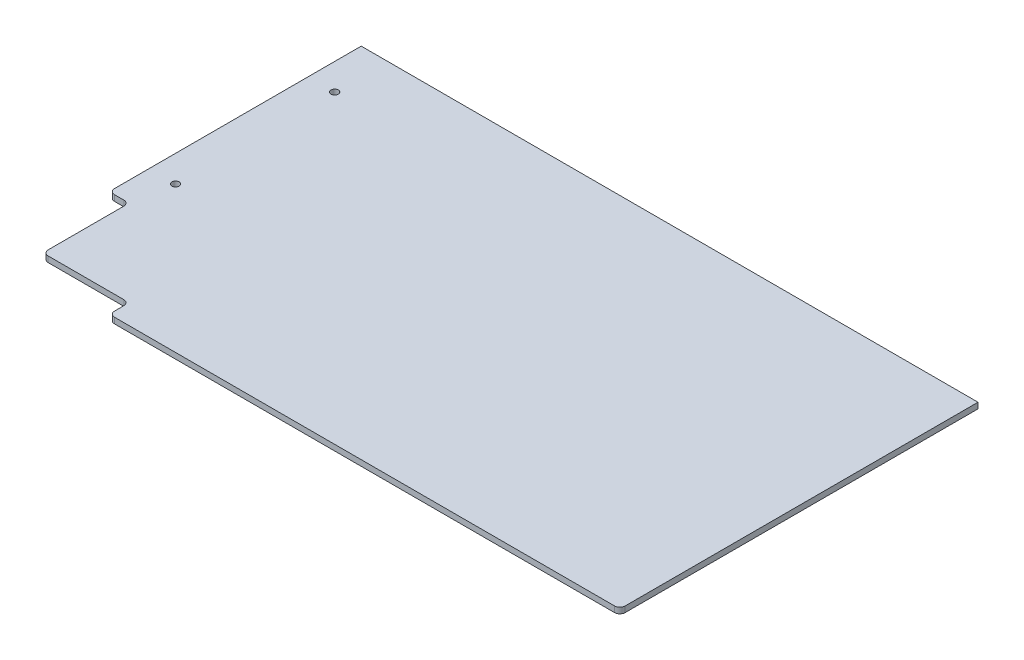
ISO-10303-21;
HEADER;
FILE_DESCRIPTION(('STEP AP214'),'2;1');
FILE_NAME('part.step','',(''),(''),'','','');
FILE_SCHEMA(('AUTOMOTIVE_DESIGN { 1 0 10303 214 1 1 1 1 }'));
ENDSEC;
DATA;
#1=APPLICATION_CONTEXT('core data for automotive mechanical design processes');
#2=APPLICATION_PROTOCOL_DEFINITION('international standard','automotive_design',2000,#1);
#3=PRODUCT_CONTEXT('',#1,'mechanical');
#4=PRODUCT('Part','Part','',(#3));
#5=PRODUCT_RELATED_PRODUCT_CATEGORY('part','',(#4));
#6=PRODUCT_DEFINITION_FORMATION('','',#4);
#7=PRODUCT_DEFINITION_CONTEXT('part definition',#1,'design');
#8=PRODUCT_DEFINITION('design','',#6,#7);
#9=PRODUCT_DEFINITION_SHAPE('','',#8);
#10=(LENGTH_UNIT() NAMED_UNIT(*) SI_UNIT(.MILLI.,.METRE.));
#11=(NAMED_UNIT(*) PLANE_ANGLE_UNIT() SI_UNIT($,.RADIAN.));
#12=(NAMED_UNIT(*) SI_UNIT($,.STERADIAN.) SOLID_ANGLE_UNIT());
#13=UNCERTAINTY_MEASURE_WITH_UNIT(LENGTH_MEASURE(1.E-05),#10,'distance_accuracy_value','');
#14=(GEOMETRIC_REPRESENTATION_CONTEXT(3) GLOBAL_UNCERTAINTY_ASSIGNED_CONTEXT((#13)) GLOBAL_UNIT_ASSIGNED_CONTEXT((#10,
#11,#12)) REPRESENTATION_CONTEXT('',''));
#15=CARTESIAN_POINT('',(0.,0.,0.));
#16=DIRECTION('',(0.,0.,1.));
#17=DIRECTION('',(1.,0.,0.));
#18=AXIS2_PLACEMENT_3D('',#15,#16,#17);
#19=CARTESIAN_POINT('',(0.,2.778125,0.));
#20=DIRECTION('',(1.,0.,0.));
#21=DIRECTION('',(0.,0.,-1.));
#22=AXIS2_PLACEMENT_3D('',#19,#20,#21);
#23=PLANE('',#22);
#24=DIRECTION('',(0.,0.,1.));
#25=VECTOR('',#24,1.);
#26=CARTESIAN_POINT('',(0.,0.,0.));
#27=LINE('',#26,#25);
#28=CARTESIAN_POINT('',(0.,0.,-190.5));
#29=VERTEX_POINT('',#28);
#30=CARTESIAN_POINT('',(0.,0.,-72.39));
#31=VERTEX_POINT('',#30);
#32=EDGE_CURVE('E170',#29,#31,#27,.T.);
#33=ORIENTED_EDGE('',*,*,#32,.T.);
#34=DIRECTION('',(0.,1.,0.));
#35=VECTOR('',#34,1.);
#36=CARTESIAN_POINT('',(0.,2.778125,-72.39));
#37=LINE('',#36,#35);
#38=CARTESIAN_POINT('',(0.,2.778125,-72.39));
#39=VERTEX_POINT('',#38);
#40=EDGE_CURVE('E226',#31,#39,#37,.T.);
#41=ORIENTED_EDGE('',*,*,#40,.T.);
#42=DIRECTION('',(0.,0.,1.));
#43=VECTOR('',#42,1.);
#44=CARTESIAN_POINT('',(0.,2.778125,0.));
#45=LINE('',#44,#43);
#46=CARTESIAN_POINT('',(0.,2.778125,-190.5));
#47=VERTEX_POINT('',#46);
#48=EDGE_CURVE('E171',#47,#39,#45,.T.);
#49=ORIENTED_EDGE('',*,*,#48,.F.);
#50=DIRECTION('',(0.,-1.,0.));
#51=VECTOR('',#50,1.);
#52=CARTESIAN_POINT('',(0.,2.778125,-190.5));
#53=LINE('',#52,#51);
#54=EDGE_CURVE('E179',#47,#29,#53,.T.);
#55=ORIENTED_EDGE('',*,*,#54,.T.);
#56=EDGE_LOOP('',(#33,#41,#49,#55));
#57=FACE_BOUND('',#56,.T.);
#58=ADVANCED_FACE('F39',(#57),#23,.F.);
#59=CARTESIAN_POINT('',(0.,2.778125,-190.5));
#60=DIRECTION('',(0.,0.,1.));
#61=DIRECTION('',(1.,0.,0.));
#62=AXIS2_PLACEMENT_3D('',#59,#60,#61);
#63=PLANE('',#62);
#64=DIRECTION('',(-1.,0.,0.));
#65=VECTOR('',#64,1.);
#66=CARTESIAN_POINT('',(0.,2.778125,-190.5));
#67=LINE('',#66,#65);
#68=CARTESIAN_POINT('',(295.275,2.778125,-190.5));
#69=VERTEX_POINT('',#68);
#70=EDGE_CURVE('E165',#69,#47,#67,.T.);
#71=ORIENTED_EDGE('',*,*,#70,.F.);
#72=DIRECTION('',(0.,1.,0.));
#73=VECTOR('',#72,1.);
#74=CARTESIAN_POINT('',(295.275,0.,-190.5));
#75=LINE('',#74,#73);
#76=CARTESIAN_POINT('',(295.275,0.,-190.5));
#77=VERTEX_POINT('',#76);
#78=EDGE_CURVE('E151',#77,#69,#75,.T.);
#79=ORIENTED_EDGE('',*,*,#78,.F.);
#80=DIRECTION('',(-1.,0.,0.));
#81=VECTOR('',#80,1.);
#82=CARTESIAN_POINT('',(0.,0.,-190.5));
#83=LINE('',#82,#81);
#84=EDGE_CURVE('E163',#77,#29,#83,.T.);
#85=ORIENTED_EDGE('',*,*,#84,.T.);
#86=ORIENTED_EDGE('',*,*,#54,.F.);
#87=EDGE_LOOP('',(#71,#79,#85,#86));
#88=FACE_BOUND('',#87,.T.);
#89=ADVANCED_FACE('F161',(#88),#63,.F.);
#90=CARTESIAN_POINT('',(0.,2.778125,0.));
#91=DIRECTION('',(0.,-1.,0.));
#92=DIRECTION('',(0.,0.,-1.));
#93=AXIS2_PLACEMENT_3D('',#90,#91,#92);
#94=PLANE('',#93);
#95=CARTESIAN_POINT('',(12.7,2.778125,-165.1));
#96=DIRECTION('',(0.,1.,0.));
#97=DIRECTION('',(0.,0.,1.));
#98=AXIS2_PLACEMENT_3D('',#95,#96,#97);
#99=CIRCLE('',#98,1.7526);
#100=CARTESIAN_POINT('',(12.7,2.778125,-163.3474));
#101=VERTEX_POINT('',#100);
#102=EDGE_CURVE('E446',#101,#101,#99,.T.);
#103=ORIENTED_EDGE('',*,*,#102,.F.);
#104=EDGE_LOOP('',(#103));
#105=FACE_BOUND('',#104,.T.);
#106=CARTESIAN_POINT('',(12.7,2.778125,-88.9));
#107=DIRECTION('',(0.,1.,0.));
#108=DIRECTION('',(0.,0.,1.));
#109=AXIS2_PLACEMENT_3D('',#106,#107,#108);
#110=CIRCLE('',#109,1.7526);
#111=CARTESIAN_POINT('',(12.7,2.778125,-87.1474));
#112=VERTEX_POINT('',#111);
#113=EDGE_CURVE('E166',#112,#112,#110,.T.);
#114=ORIENTED_EDGE('',*,*,#113,.F.);
#115=EDGE_LOOP('',(#114));
#116=FACE_BOUND('',#115,.T.);
#117=DIRECTION('',(-1.,0.,0.));
#118=VECTOR('',#117,1.);
#119=CARTESIAN_POINT('',(0.,2.778125,-19.05));
#120=LINE('',#119,#118);
#121=CARTESIAN_POINT('',(292.735,2.778125,-19.05));
#122=VERTEX_POINT('',#121);
#123=CARTESIAN_POINT('',(53.34,2.778125,-19.05));
#124=VERTEX_POINT('',#123);
#125=EDGE_CURVE('E257',#122,#124,#120,.T.);
#126=ORIENTED_EDGE('',*,*,#125,.F.);
#127=CARTESIAN_POINT('',(292.735,2.778125,-21.59));
#128=DIRECTION('',(0.,-1.,0.));
#129=DIRECTION('',(0.,0.,-1.));
#130=AXIS2_PLACEMENT_3D('',#127,#128,#129);
#131=CIRCLE('',#130,2.54);
#132=CARTESIAN_POINT('',(295.275,2.778125,-21.59));
#133=VERTEX_POINT('',#132);
#134=EDGE_CURVE('E193',#122,#133,#131,.F.);
#135=ORIENTED_EDGE('',*,*,#134,.T.);
#136=DIRECTION('',(0.,0.,1.));
#137=VECTOR('',#136,1.);
#138=CARTESIAN_POINT('',(295.275,2.778125,-190.5));
#139=LINE('',#138,#137);
#140=EDGE_CURVE('E157',#69,#133,#139,.T.);
#141=ORIENTED_EDGE('',*,*,#140,.F.);
#142=ORIENTED_EDGE('',*,*,#70,.T.);
#143=ORIENTED_EDGE('',*,*,#48,.T.);
#144=CARTESIAN_POINT('',(2.54,2.778125,-72.39));
#145=DIRECTION('',(0.,-1.,0.));
#146=DIRECTION('',(0.,0.,-1.));
#147=AXIS2_PLACEMENT_3D('',#144,#145,#146);
#148=CIRCLE('',#147,2.54);
#149=CARTESIAN_POINT('',(2.54,2.778125,-69.85));
#150=VERTEX_POINT('',#149);
#151=EDGE_CURVE('E186',#39,#150,#148,.F.);
#152=ORIENTED_EDGE('',*,*,#151,.T.);
#153=DIRECTION('',(-1.,0.,0.));
#154=VECTOR('',#153,1.);
#155=CARTESIAN_POINT('',(0.,2.778125,-69.85));
#156=LINE('',#155,#154);
#157=CARTESIAN_POINT('',(6.985,2.778125,-69.85));
#158=VERTEX_POINT('',#157);
#159=EDGE_CURVE('E241',#158,#150,#156,.T.);
#160=ORIENTED_EDGE('',*,*,#159,.F.);
#161=CARTESIAN_POINT('',(6.985,2.778125,-67.31));
#162=DIRECTION('',(0.,-1.,0.));
#163=DIRECTION('',(0.,0.,-1.));
#164=AXIS2_PLACEMENT_3D('',#161,#162,#163);
#165=CIRCLE('',#164,2.54);
#166=CARTESIAN_POINT('',(9.525,2.778125,-67.31));
#167=VERTEX_POINT('',#166);
#168=EDGE_CURVE('E47',#158,#167,#165,.T.);
#169=ORIENTED_EDGE('',*,*,#168,.T.);
#170=DIRECTION('',(0.,0.,-1.));
#171=VECTOR('',#170,1.);
#172=CARTESIAN_POINT('',(9.525,2.778125,-69.85));
#173=LINE('',#172,#171);
#174=CARTESIAN_POINT('',(9.52500000000001,2.778125,-31.115));
#175=VERTEX_POINT('',#174);
#176=EDGE_CURVE('E240',#175,#167,#173,.T.);
#177=ORIENTED_EDGE('',*,*,#176,.F.);
#178=CARTESIAN_POINT('',(12.065,2.778125,-31.115));
#179=DIRECTION('',(0.,-1.,0.));
#180=DIRECTION('',(0.,0.,-1.));
#181=AXIS2_PLACEMENT_3D('',#178,#179,#180);
#182=CIRCLE('',#181,2.54);
#183=CARTESIAN_POINT('',(12.065,2.778125,-28.575));
#184=VERTEX_POINT('',#183);
#185=EDGE_CURVE('E188',#175,#184,#182,.F.);
#186=ORIENTED_EDGE('',*,*,#185,.T.);
#187=DIRECTION('',(-1.,0.,0.));
#188=VECTOR('',#187,1.);
#189=CARTESIAN_POINT('',(9.52500000000001,2.778125,-28.575));
#190=LINE('',#189,#188);
#191=CARTESIAN_POINT('',(48.26,2.778125,-28.575));
#192=VERTEX_POINT('',#191);
#193=EDGE_CURVE('E250',#192,#184,#190,.T.);
#194=ORIENTED_EDGE('',*,*,#193,.F.);
#195=CARTESIAN_POINT('',(48.26,2.778125,-26.035));
#196=DIRECTION('',(0.,-1.,0.));
#197=DIRECTION('',(0.,0.,-1.));
#198=AXIS2_PLACEMENT_3D('',#195,#196,#197);
#199=CIRCLE('',#198,2.54);
#200=CARTESIAN_POINT('',(50.8,2.778125,-26.035));
#201=VERTEX_POINT('',#200);
#202=EDGE_CURVE('E229',#192,#201,#199,.T.);
#203=ORIENTED_EDGE('',*,*,#202,.T.);
#204=DIRECTION('',(0.,0.,-1.));
#205=VECTOR('',#204,1.);
#206=CARTESIAN_POINT('',(50.8,2.778125,-28.575));
#207=LINE('',#206,#205);
#208=CARTESIAN_POINT('',(50.8,2.778125,-21.59));
#209=VERTEX_POINT('',#208);
#210=EDGE_CURVE('E265',#209,#201,#207,.T.);
#211=ORIENTED_EDGE('',*,*,#210,.F.);
#212=CARTESIAN_POINT('',(53.34,2.778125,-21.59));
#213=DIRECTION('',(0.,-1.,0.));
#214=DIRECTION('',(0.,0.,-1.));
#215=AXIS2_PLACEMENT_3D('',#212,#213,#214);
#216=CIRCLE('',#215,2.54);
#217=EDGE_CURVE('E190',#209,#124,#216,.F.);
#218=ORIENTED_EDGE('',*,*,#217,.T.);
#219=EDGE_LOOP('',(#126,#135,#141,#142,#143,#152,#160,#169,#177,#186,#194,#203,#211,#218));
#220=FACE_BOUND('',#219,.T.);
#221=ADVANCED_FACE('F239',(#105,#116,#220),#94,.F.);
#222=CARTESIAN_POINT('',(0.,0.,0.));
#223=DIRECTION('',(0.,-1.,0.));
#224=DIRECTION('',(0.,0.,-1.));
#225=AXIS2_PLACEMENT_3D('',#222,#223,#224);
#226=PLANE('',#225);
#227=DIRECTION('',(0.,0.,1.));
#228=VECTOR('',#227,1.);
#229=CARTESIAN_POINT('',(295.275,0.,-190.5));
#230=LINE('',#229,#228);
#231=CARTESIAN_POINT('',(295.275,0.,-21.59));
#232=VERTEX_POINT('',#231);
#233=EDGE_CURVE('E147',#77,#232,#230,.T.);
#234=ORIENTED_EDGE('',*,*,#233,.T.);
#235=CARTESIAN_POINT('',(292.735,0.,-21.59));
#236=DIRECTION('',(0.,-1.,0.));
#237=DIRECTION('',(0.,0.,-1.));
#238=AXIS2_PLACEMENT_3D('',#235,#236,#237);
#239=CIRCLE('',#238,2.54);
#240=CARTESIAN_POINT('',(292.735,0.,-19.05));
#241=VERTEX_POINT('',#240);
#242=EDGE_CURVE('E202',#232,#241,#239,.T.);
#243=ORIENTED_EDGE('',*,*,#242,.T.);
#244=DIRECTION('',(-1.,0.,0.));
#245=VECTOR('',#244,1.);
#246=CARTESIAN_POINT('',(0.,0.,-19.05));
#247=LINE('',#246,#245);
#248=CARTESIAN_POINT('',(53.34,0.,-19.05));
#249=VERTEX_POINT('',#248);
#250=EDGE_CURVE('E175',#241,#249,#247,.T.);
#251=ORIENTED_EDGE('',*,*,#250,.T.);
#252=CARTESIAN_POINT('',(53.34,0.,-21.59));
#253=DIRECTION('',(0.,-1.,0.));
#254=DIRECTION('',(0.,0.,-1.));
#255=AXIS2_PLACEMENT_3D('',#252,#253,#254);
#256=CIRCLE('',#255,2.54);
#257=CARTESIAN_POINT('',(50.8,0.,-21.59));
#258=VERTEX_POINT('',#257);
#259=EDGE_CURVE('E199',#249,#258,#256,.T.);
#260=ORIENTED_EDGE('',*,*,#259,.T.);
#261=DIRECTION('',(0.,0.,-1.));
#262=VECTOR('',#261,1.);
#263=CARTESIAN_POINT('',(50.8,0.,-28.575));
#264=LINE('',#263,#262);
#265=CARTESIAN_POINT('',(50.8,0.,-26.035));
#266=VERTEX_POINT('',#265);
#267=EDGE_CURVE('E274',#258,#266,#264,.T.);
#268=ORIENTED_EDGE('',*,*,#267,.T.);
#269=CARTESIAN_POINT('',(48.26,0.,-26.035));
#270=DIRECTION('',(0.,-1.,0.));
#271=DIRECTION('',(0.,0.,-1.));
#272=AXIS2_PLACEMENT_3D('',#269,#270,#271);
#273=CIRCLE('',#272,2.54);
#274=CARTESIAN_POINT('',(48.26,0.,-28.575));
#275=VERTEX_POINT('',#274);
#276=EDGE_CURVE('E232',#266,#275,#273,.F.);
#277=ORIENTED_EDGE('',*,*,#276,.T.);
#278=DIRECTION('',(-1.,0.,0.));
#279=VECTOR('',#278,1.);
#280=CARTESIAN_POINT('',(9.52500000000001,0.,-28.575));
#281=LINE('',#280,#279);
#282=CARTESIAN_POINT('',(12.065,0.,-28.575));
#283=VERTEX_POINT('',#282);
#284=EDGE_CURVE('E261',#275,#283,#281,.T.);
#285=ORIENTED_EDGE('',*,*,#284,.T.);
#286=CARTESIAN_POINT('',(12.065,0.,-31.115));
#287=DIRECTION('',(0.,-1.,0.));
#288=DIRECTION('',(0.,0.,-1.));
#289=AXIS2_PLACEMENT_3D('',#286,#287,#288);
#290=CIRCLE('',#289,2.54);
#291=CARTESIAN_POINT('',(9.52500000000001,0.,-31.115));
#292=VERTEX_POINT('',#291);
#293=EDGE_CURVE('E197',#283,#292,#290,.T.);
#294=ORIENTED_EDGE('',*,*,#293,.T.);
#295=DIRECTION('',(0.,0.,-1.));
#296=VECTOR('',#295,1.);
#297=CARTESIAN_POINT('',(9.525,0.,-69.85));
#298=LINE('',#297,#296);
#299=CARTESIAN_POINT('',(9.525,0.,-67.31));
#300=VERTEX_POINT('',#299);
#301=EDGE_CURVE('E255',#292,#300,#298,.T.);
#302=ORIENTED_EDGE('',*,*,#301,.T.);
#303=CARTESIAN_POINT('',(6.985,0.,-67.31));
#304=DIRECTION('',(0.,-1.,0.));
#305=DIRECTION('',(0.,0.,-1.));
#306=AXIS2_PLACEMENT_3D('',#303,#304,#305);
#307=CIRCLE('',#306,2.54);
#308=CARTESIAN_POINT('',(6.985,0.,-69.85));
#309=VERTEX_POINT('',#308);
#310=EDGE_CURVE('E11',#300,#309,#307,.F.);
#311=ORIENTED_EDGE('',*,*,#310,.T.);
#312=DIRECTION('',(-1.,0.,0.));
#313=VECTOR('',#312,1.);
#314=CARTESIAN_POINT('',(0.,0.,-69.85));
#315=LINE('',#314,#313);
#316=CARTESIAN_POINT('',(2.54,0.,-69.85));
#317=VERTEX_POINT('',#316);
#318=EDGE_CURVE('E254',#309,#317,#315,.T.);
#319=ORIENTED_EDGE('',*,*,#318,.T.);
#320=CARTESIAN_POINT('',(2.54,0.,-72.39));
#321=DIRECTION('',(0.,-1.,0.));
#322=DIRECTION('',(0.,0.,-1.));
#323=AXIS2_PLACEMENT_3D('',#320,#321,#322);
#324=CIRCLE('',#323,2.54);
#325=EDGE_CURVE('E54',#317,#31,#324,.T.);
#326=ORIENTED_EDGE('',*,*,#325,.T.);
#327=ORIENTED_EDGE('',*,*,#32,.F.);
#328=ORIENTED_EDGE('',*,*,#84,.F.);
#329=EDGE_LOOP('',(#234,#243,#251,#260,#268,#277,#285,#294,#302,#311,#319,#326,#327,#328));
#330=FACE_BOUND('',#329,.T.);
#331=CARTESIAN_POINT('',(12.7,0.,-165.1));
#332=DIRECTION('',(0.,1.,0.));
#333=DIRECTION('',(0.,0.,1.));
#334=AXIS2_PLACEMENT_3D('',#331,#332,#333);
#335=CIRCLE('',#334,1.7526);
#336=CARTESIAN_POINT('',(12.7,0.,-163.3474));
#337=VERTEX_POINT('',#336);
#338=EDGE_CURVE('E269',#337,#337,#335,.T.);
#339=ORIENTED_EDGE('',*,*,#338,.T.);
#340=EDGE_LOOP('',(#339));
#341=FACE_BOUND('',#340,.T.);
#342=CARTESIAN_POINT('',(12.7,0.,-88.9));
#343=DIRECTION('',(0.,1.,0.));
#344=DIRECTION('',(0.,0.,1.));
#345=AXIS2_PLACEMENT_3D('',#342,#343,#344);
#346=CIRCLE('',#345,1.7526);
#347=CARTESIAN_POINT('',(12.7,0.,-87.1474));
#348=VERTEX_POINT('',#347);
#349=EDGE_CURVE('E450',#348,#348,#346,.T.);
#350=ORIENTED_EDGE('',*,*,#349,.T.);
#351=EDGE_LOOP('',(#350));
#352=FACE_BOUND('',#351,.T.);
#353=ADVANCED_FACE('F168',(#330,#341,#352),#226,.T.);
#354=CARTESIAN_POINT('',(0.,0.,-19.05));
#355=DIRECTION('',(0.,0.,-1.));
#356=DIRECTION('',(-1.,0.,0.));
#357=AXIS2_PLACEMENT_3D('',#354,#355,#356);
#358=PLANE('',#357);
#359=ORIENTED_EDGE('',*,*,#250,.F.);
#360=DIRECTION('',(0.,1.,0.));
#361=VECTOR('',#360,1.);
#362=CARTESIAN_POINT('',(292.735,0.,-19.05));
#363=LINE('',#362,#361);
#364=EDGE_CURVE('E183',#241,#122,#363,.T.);
#365=ORIENTED_EDGE('',*,*,#364,.T.);
#366=ORIENTED_EDGE('',*,*,#125,.T.);
#367=DIRECTION('',(0.,1.,0.));
#368=VECTOR('',#367,1.);
#369=CARTESIAN_POINT('',(53.34,0.,-19.05));
#370=LINE('',#369,#368);
#371=EDGE_CURVE('E181',#124,#249,#370,.F.);
#372=ORIENTED_EDGE('',*,*,#371,.T.);
#373=EDGE_LOOP('',(#359,#365,#366,#372));
#374=FACE_BOUND('',#373,.T.);
#375=ADVANCED_FACE('F396',(#374),#358,.F.);
#376=CARTESIAN_POINT('',(0.,0.,-69.85));
#377=DIRECTION('',(0.,0.,-1.));
#378=DIRECTION('',(-1.,0.,0.));
#379=AXIS2_PLACEMENT_3D('',#376,#377,#378);
#380=PLANE('',#379);
#381=ORIENTED_EDGE('',*,*,#318,.F.);
#382=DIRECTION('',(0.,1.,0.));
#383=VECTOR('',#382,1.);
#384=CARTESIAN_POINT('',(6.985,2.778125,-69.85));
#385=LINE('',#384,#383);
#386=EDGE_CURVE('E218',#309,#158,#385,.T.);
#387=ORIENTED_EDGE('',*,*,#386,.T.);
#388=ORIENTED_EDGE('',*,*,#159,.T.);
#389=DIRECTION('',(0.,1.,0.));
#390=VECTOR('',#389,1.);
#391=CARTESIAN_POINT('',(2.54,0.,-69.85));
#392=LINE('',#391,#390);
#393=EDGE_CURVE('E62',#150,#317,#392,.F.);
#394=ORIENTED_EDGE('',*,*,#393,.T.);
#395=EDGE_LOOP('',(#381,#387,#388,#394));
#396=FACE_BOUND('',#395,.T.);
#397=ADVANCED_FACE('F256',(#396),#380,.F.);
#398=CARTESIAN_POINT('',(9.525,0.,-69.85));
#399=DIRECTION('',(1.,0.,0.));
#400=DIRECTION('',(0.,0.,-1.));
#401=AXIS2_PLACEMENT_3D('',#398,#399,#400);
#402=PLANE('',#401);
#403=ORIENTED_EDGE('',*,*,#176,.T.);
#404=DIRECTION('',(0.,1.,0.));
#405=VECTOR('',#404,1.);
#406=CARTESIAN_POINT('',(9.525,0.,-67.31));
#407=LINE('',#406,#405);
#408=EDGE_CURVE('E224',#167,#300,#407,.F.);
#409=ORIENTED_EDGE('',*,*,#408,.T.);
#410=ORIENTED_EDGE('',*,*,#301,.F.);
#411=DIRECTION('',(0.,1.,0.));
#412=VECTOR('',#411,1.);
#413=CARTESIAN_POINT('',(9.52500000000001,0.,-31.115));
#414=LINE('',#413,#412);
#415=EDGE_CURVE('E221',#292,#175,#414,.T.);
#416=ORIENTED_EDGE('',*,*,#415,.T.);
#417=EDGE_LOOP('',(#403,#409,#410,#416));
#418=FACE_BOUND('',#417,.T.);
#419=ADVANCED_FACE('F246',(#418),#402,.F.);
#420=CARTESIAN_POINT('',(9.52500000000001,0.,-28.575));
#421=DIRECTION('',(0.,0.,-1.));
#422=DIRECTION('',(-1.,0.,0.));
#423=AXIS2_PLACEMENT_3D('',#420,#421,#422);
#424=PLANE('',#423);
#425=ORIENTED_EDGE('',*,*,#284,.F.);
#426=DIRECTION('',(0.,1.,0.));
#427=VECTOR('',#426,1.);
#428=CARTESIAN_POINT('',(48.26,2.778125,-28.575));
#429=LINE('',#428,#427);
#430=EDGE_CURVE('E213',#275,#192,#429,.T.);
#431=ORIENTED_EDGE('',*,*,#430,.T.);
#432=ORIENTED_EDGE('',*,*,#193,.T.);
#433=DIRECTION('',(0.,1.,0.));
#434=VECTOR('',#433,1.);
#435=CARTESIAN_POINT('',(12.065,0.,-28.575));
#436=LINE('',#435,#434);
#437=EDGE_CURVE('E211',#184,#283,#436,.F.);
#438=ORIENTED_EDGE('',*,*,#437,.T.);
#439=EDGE_LOOP('',(#425,#431,#432,#438));
#440=FACE_BOUND('',#439,.T.);
#441=ADVANCED_FACE('F372',(#440),#424,.F.);
#442=CARTESIAN_POINT('',(50.8,0.,-28.575));
#443=DIRECTION('',(1.,0.,0.));
#444=DIRECTION('',(0.,0.,-1.));
#445=AXIS2_PLACEMENT_3D('',#442,#443,#444);
#446=PLANE('',#445);
#447=ORIENTED_EDGE('',*,*,#267,.F.);
#448=DIRECTION('',(0.,1.,0.));
#449=VECTOR('',#448,1.);
#450=CARTESIAN_POINT('',(50.8,0.,-21.59));
#451=LINE('',#450,#449);
#452=EDGE_CURVE('E207',#258,#209,#451,.T.);
#453=ORIENTED_EDGE('',*,*,#452,.T.);
#454=ORIENTED_EDGE('',*,*,#210,.T.);
#455=DIRECTION('',(0.,1.,0.));
#456=VECTOR('',#455,1.);
#457=CARTESIAN_POINT('',(50.8,0.,-26.035));
#458=LINE('',#457,#456);
#459=EDGE_CURVE('E204',#201,#266,#458,.F.);
#460=ORIENTED_EDGE('',*,*,#459,.T.);
#461=EDGE_LOOP('',(#447,#453,#454,#460));
#462=FACE_BOUND('',#461,.T.);
#463=ADVANCED_FACE('F364',(#462),#446,.F.);
#464=CARTESIAN_POINT('',(12.7,0.,-88.9));
#465=DIRECTION('',(0.,1.,0.));
#466=DIRECTION('',(0.,0.,1.));
#467=AXIS2_PLACEMENT_3D('',#464,#465,#466);
#468=CYLINDRICAL_SURFACE('',#467,1.7526);
#469=ORIENTED_EDGE('',*,*,#349,.F.);
#470=EDGE_LOOP('',(#469));
#471=FACE_BOUND('',#470,.T.);
#472=ORIENTED_EDGE('',*,*,#113,.T.);
#473=EDGE_LOOP('',(#472));
#474=FACE_BOUND('',#473,.T.);
#475=ADVANCED_FACE('F354',(#471,#474),#468,.F.);
#476=CARTESIAN_POINT('',(12.7,0.,-165.1));
#477=DIRECTION('',(0.,1.,0.));
#478=DIRECTION('',(0.,0.,1.));
#479=AXIS2_PLACEMENT_3D('',#476,#477,#478);
#480=CYLINDRICAL_SURFACE('',#479,1.7526);
#481=ORIENTED_EDGE('',*,*,#338,.F.);
#482=EDGE_LOOP('',(#481));
#483=FACE_BOUND('',#482,.T.);
#484=ORIENTED_EDGE('',*,*,#102,.T.);
#485=EDGE_LOOP('',(#484));
#486=FACE_BOUND('',#485,.T.);
#487=ADVANCED_FACE('F345',(#483,#486),#480,.F.);
#488=CARTESIAN_POINT('',(295.275,0.,-190.5));
#489=DIRECTION('',(-1.,0.,0.));
#490=DIRECTION('',(0.,0.,1.));
#491=AXIS2_PLACEMENT_3D('',#488,#489,#490);
#492=PLANE('',#491);
#493=ORIENTED_EDGE('',*,*,#140,.T.);
#494=DIRECTION('',(0.,1.,0.));
#495=VECTOR('',#494,1.);
#496=CARTESIAN_POINT('',(295.275,0.,-21.59));
#497=LINE('',#496,#495);
#498=EDGE_CURVE('E154',#133,#232,#497,.F.);
#499=ORIENTED_EDGE('',*,*,#498,.T.);
#500=ORIENTED_EDGE('',*,*,#233,.F.);
#501=ORIENTED_EDGE('',*,*,#78,.T.);
#502=EDGE_LOOP('',(#493,#499,#500,#501));
#503=FACE_BOUND('',#502,.T.);
#504=ADVANCED_FACE('F150',(#503),#492,.F.);
#505=CARTESIAN_POINT('',(292.735,0.,-21.59));
#506=DIRECTION('',(0.,1.,0.));
#507=DIRECTION('',(0.,0.,1.));
#508=AXIS2_PLACEMENT_3D('',#505,#506,#507);
#509=CYLINDRICAL_SURFACE('',#508,2.54);
#510=ORIENTED_EDGE('',*,*,#242,.F.);
#511=ORIENTED_EDGE('',*,*,#498,.F.);
#512=ORIENTED_EDGE('',*,*,#134,.F.);
#513=ORIENTED_EDGE('',*,*,#364,.F.);
#514=EDGE_LOOP('',(#510,#511,#512,#513));
#515=FACE_BOUND('',#514,.T.);
#516=ADVANCED_FACE('F294',(#515),#509,.T.);
#517=CARTESIAN_POINT('',(53.34,0.,-21.59));
#518=DIRECTION('',(0.,1.,0.));
#519=DIRECTION('',(0.,0.,1.));
#520=AXIS2_PLACEMENT_3D('',#517,#518,#519);
#521=CYLINDRICAL_SURFACE('',#520,2.54);
#522=ORIENTED_EDGE('',*,*,#259,.F.);
#523=ORIENTED_EDGE('',*,*,#371,.F.);
#524=ORIENTED_EDGE('',*,*,#217,.F.);
#525=ORIENTED_EDGE('',*,*,#452,.F.);
#526=EDGE_LOOP('',(#522,#523,#524,#525));
#527=FACE_BOUND('',#526,.T.);
#528=ADVANCED_FACE('F297',(#527),#521,.T.);
#529=CARTESIAN_POINT('',(48.26,0.,-26.035));
#530=DIRECTION('',(0.,-1.,0.));
#531=DIRECTION('',(0.,0.,-1.));
#532=AXIS2_PLACEMENT_3D('',#529,#530,#531);
#533=CYLINDRICAL_SURFACE('',#532,2.54);
#534=ORIENTED_EDGE('',*,*,#276,.F.);
#535=ORIENTED_EDGE('',*,*,#459,.F.);
#536=ORIENTED_EDGE('',*,*,#202,.F.);
#537=ORIENTED_EDGE('',*,*,#430,.F.);
#538=EDGE_LOOP('',(#534,#535,#536,#537));
#539=FACE_BOUND('',#538,.T.);
#540=ADVANCED_FACE('F301',(#539),#533,.F.);
#541=CARTESIAN_POINT('',(6.985,0.,-67.31));
#542=DIRECTION('',(0.,-1.,0.));
#543=DIRECTION('',(0.,0.,-1.));
#544=AXIS2_PLACEMENT_3D('',#541,#542,#543);
#545=CYLINDRICAL_SURFACE('',#544,2.54);
#546=ORIENTED_EDGE('',*,*,#310,.F.);
#547=ORIENTED_EDGE('',*,*,#408,.F.);
#548=ORIENTED_EDGE('',*,*,#168,.F.);
#549=ORIENTED_EDGE('',*,*,#386,.F.);
#550=EDGE_LOOP('',(#546,#547,#548,#549));
#551=FACE_BOUND('',#550,.T.);
#552=ADVANCED_FACE('F253',(#551),#545,.F.);
#553=CARTESIAN_POINT('',(12.065,0.,-31.115));
#554=DIRECTION('',(0.,1.,0.));
#555=DIRECTION('',(0.,0.,1.));
#556=AXIS2_PLACEMENT_3D('',#553,#554,#555);
#557=CYLINDRICAL_SURFACE('',#556,2.54);
#558=ORIENTED_EDGE('',*,*,#293,.F.);
#559=ORIENTED_EDGE('',*,*,#437,.F.);
#560=ORIENTED_EDGE('',*,*,#185,.F.);
#561=ORIENTED_EDGE('',*,*,#415,.F.);
#562=EDGE_LOOP('',(#558,#559,#560,#561));
#563=FACE_BOUND('',#562,.T.);
#564=ADVANCED_FACE('F281',(#563),#557,.T.);
#565=CARTESIAN_POINT('',(2.54,2.778125,-72.39));
#566=DIRECTION('',(0.,1.,0.));
#567=DIRECTION('',(0.,0.,1.));
#568=AXIS2_PLACEMENT_3D('',#565,#566,#567);
#569=CYLINDRICAL_SURFACE('',#568,2.54);
#570=ORIENTED_EDGE('',*,*,#325,.F.);
#571=ORIENTED_EDGE('',*,*,#393,.F.);
#572=ORIENTED_EDGE('',*,*,#151,.F.);
#573=ORIENTED_EDGE('',*,*,#40,.F.);
#574=EDGE_LOOP('',(#570,#571,#572,#573));
#575=FACE_BOUND('',#574,.T.);
#576=ADVANCED_FACE('F41',(#575),#569,.T.);
#577=CLOSED_SHELL('',(#58,#89,#221,#353,#375,#397,#419,#441,#463,#475,#487,#504,#516,#528,#540,
#552,#564,#576));
#578=MANIFOLD_SOLID_BREP('B2',#577);
#579=ADVANCED_BREP_SHAPE_REPRESENTATION('',(#18,#578),#14);
#580=SHAPE_DEFINITION_REPRESENTATION(#9,#579);
ENDSEC;
END-ISO-10303-21;
